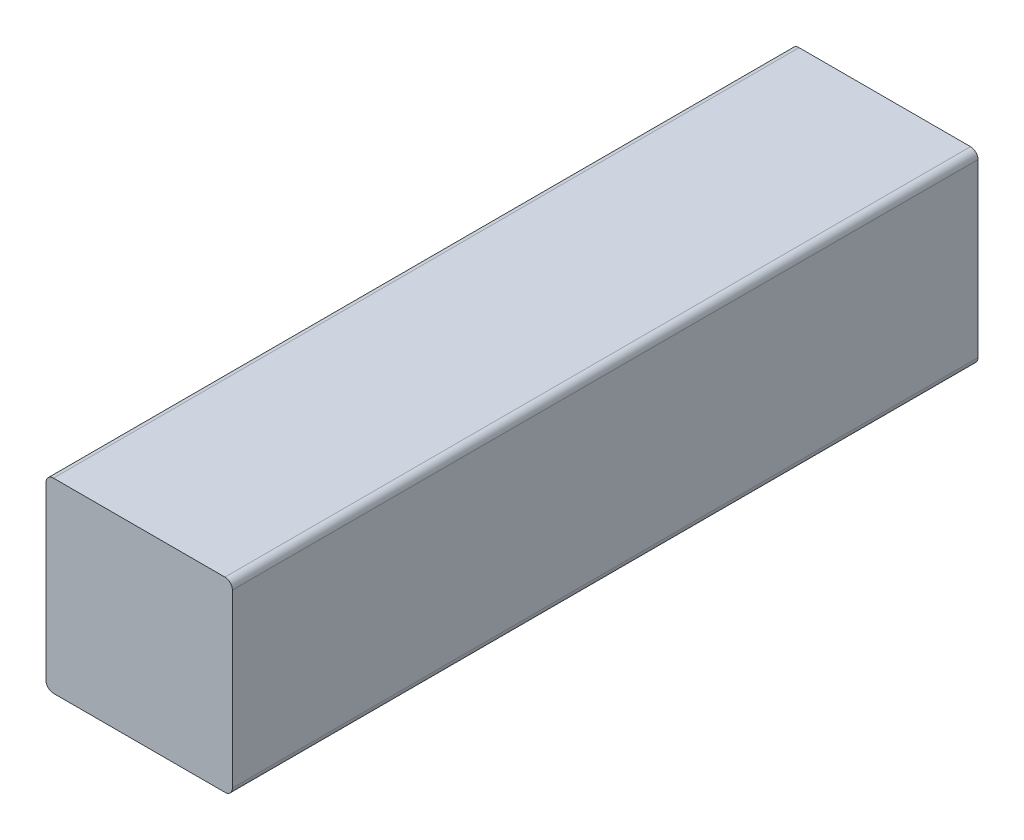
ISO-10303-21;
HEADER;
FILE_DESCRIPTION(('STEP AP214'),'2;1');
FILE_NAME('part.step','',(''),(''),'','','');
FILE_SCHEMA(('AUTOMOTIVE_DESIGN { 1 0 10303 214 1 1 1 1 }'));
ENDSEC;
DATA;
#1=APPLICATION_CONTEXT('core data for automotive mechanical design processes');
#2=APPLICATION_PROTOCOL_DEFINITION('international standard','automotive_design',2000,#1);
#3=PRODUCT_CONTEXT('',#1,'mechanical');
#4=PRODUCT('Part','Part','',(#3));
#5=PRODUCT_RELATED_PRODUCT_CATEGORY('part','',(#4));
#6=PRODUCT_DEFINITION_FORMATION('','',#4);
#7=PRODUCT_DEFINITION_CONTEXT('part definition',#1,'design');
#8=PRODUCT_DEFINITION('design','',#6,#7);
#9=PRODUCT_DEFINITION_SHAPE('','',#8);
#10=(LENGTH_UNIT() NAMED_UNIT(*) SI_UNIT(.MILLI.,.METRE.));
#11=(NAMED_UNIT(*) PLANE_ANGLE_UNIT() SI_UNIT($,.RADIAN.));
#12=(NAMED_UNIT(*) SI_UNIT($,.STERADIAN.) SOLID_ANGLE_UNIT());
#13=UNCERTAINTY_MEASURE_WITH_UNIT(LENGTH_MEASURE(1.E-05),#10,'distance_accuracy_value','');
#14=(GEOMETRIC_REPRESENTATION_CONTEXT(3) GLOBAL_UNCERTAINTY_ASSIGNED_CONTEXT((#13)) GLOBAL_UNIT_ASSIGNED_CONTEXT((#10,
#11,#12)) REPRESENTATION_CONTEXT('',''));
#15=CARTESIAN_POINT('',(0.,0.,0.));
#16=DIRECTION('',(0.,0.,1.));
#17=DIRECTION('',(1.,0.,0.));
#18=AXIS2_PLACEMENT_3D('',#15,#16,#17);
#19=CARTESIAN_POINT('',(3.175,-3.175,12.7));
#20=DIRECTION('',(0.,1.,0.));
#21=DIRECTION('',(0.,0.,1.));
#22=AXIS2_PLACEMENT_3D('',#19,#20,#21);
#23=PLANE('',#22);
#24=DIRECTION('',(-1.,0.,0.));
#25=VECTOR('',#24,1.);
#26=CARTESIAN_POINT('',(3.175,-3.175,12.7));
#27=LINE('',#26,#25);
#28=CARTESIAN_POINT('',(2.921,-3.175,12.7));
#29=VERTEX_POINT('',#28);
#30=CARTESIAN_POINT('',(-2.921,-3.175,12.7));
#31=VERTEX_POINT('',#30);
#32=EDGE_CURVE('E163',#29,#31,#27,.T.);
#33=ORIENTED_EDGE('',*,*,#32,.T.);
#34=DIRECTION('',(0.,0.,-1.));
#35=VECTOR('',#34,1.);
#36=CARTESIAN_POINT('',(-2.921,-3.175,12.7));
#37=LINE('',#36,#35);
#38=CARTESIAN_POINT('',(-2.921,-3.175,-12.7));
#39=VERTEX_POINT('',#38);
#40=EDGE_CURVE('E119',#31,#39,#37,.T.);
#41=ORIENTED_EDGE('',*,*,#40,.T.);
#42=DIRECTION('',(-1.,0.,0.));
#43=VECTOR('',#42,1.);
#44=CARTESIAN_POINT('',(3.175,-3.175,-12.7));
#45=LINE('',#44,#43);
#46=CARTESIAN_POINT('',(2.921,-3.175,-12.7));
#47=VERTEX_POINT('',#46);
#48=EDGE_CURVE('E103',#47,#39,#45,.T.);
#49=ORIENTED_EDGE('',*,*,#48,.F.);
#50=DIRECTION('',(0.,0.,-1.));
#51=VECTOR('',#50,1.);
#52=CARTESIAN_POINT('',(2.921,-3.175,12.7));
#53=LINE('',#52,#51);
#54=EDGE_CURVE('E116',#47,#29,#53,.F.);
#55=ORIENTED_EDGE('',*,*,#54,.T.);
#56=EDGE_LOOP('',(#33,#41,#49,#55));
#57=FACE_BOUND('',#56,.T.);
#58=ADVANCED_FACE('F34',(#57),#23,.F.);
#59=CARTESIAN_POINT('',(3.175,-3.175,-12.7));
#60=DIRECTION('',(0.,0.,1.));
#61=DIRECTION('',(1.,0.,0.));
#62=AXIS2_PLACEMENT_3D('',#59,#60,#61);
#63=PLANE('',#62);
#64=ORIENTED_EDGE('',*,*,#48,.T.);
#65=CARTESIAN_POINT('',(-2.921,-2.921,-12.7));
#66=DIRECTION('',(0.,0.,1.));
#67=DIRECTION('',(1.,0.,0.));
#68=AXIS2_PLACEMENT_3D('',#65,#66,#67);
#69=CIRCLE('',#68,0.254);
#70=CARTESIAN_POINT('',(-3.175,-2.921,-12.7));
#71=VERTEX_POINT('',#70);
#72=EDGE_CURVE('E110',#39,#71,#69,.F.);
#73=ORIENTED_EDGE('',*,*,#72,.T.);
#74=DIRECTION('',(0.,1.,0.));
#75=VECTOR('',#74,1.);
#76=CARTESIAN_POINT('',(-3.175,-3.175,-12.7));
#77=LINE('',#76,#75);
#78=CARTESIAN_POINT('',(-3.175,2.921,-12.7));
#79=VERTEX_POINT('',#78);
#80=EDGE_CURVE('E169',#71,#79,#77,.T.);
#81=ORIENTED_EDGE('',*,*,#80,.T.);
#82=CARTESIAN_POINT('',(-2.921,2.921,-12.7));
#83=DIRECTION('',(0.,0.,1.));
#84=DIRECTION('',(1.,0.,0.));
#85=AXIS2_PLACEMENT_3D('',#82,#83,#84);
#86=CIRCLE('',#85,0.254);
#87=CARTESIAN_POINT('',(-2.921,3.175,-12.7));
#88=VERTEX_POINT('',#87);
#89=EDGE_CURVE('E111',#79,#88,#86,.F.);
#90=ORIENTED_EDGE('',*,*,#89,.T.);
#91=DIRECTION('',(-1.,0.,0.));
#92=VECTOR('',#91,1.);
#93=CARTESIAN_POINT('',(3.175,3.175,-12.7));
#94=LINE('',#93,#92);
#95=CARTESIAN_POINT('',(2.921,3.175,-12.7));
#96=VERTEX_POINT('',#95);
#97=EDGE_CURVE('E120',#96,#88,#94,.T.);
#98=ORIENTED_EDGE('',*,*,#97,.F.);
#99=CARTESIAN_POINT('',(2.921,2.921,-12.7));
#100=DIRECTION('',(0.,0.,1.));
#101=DIRECTION('',(1.,0.,0.));
#102=AXIS2_PLACEMENT_3D('',#99,#100,#101);
#103=CIRCLE('',#102,0.254);
#104=CARTESIAN_POINT('',(3.175,2.921,-12.7));
#105=VERTEX_POINT('',#104);
#106=EDGE_CURVE('E126',#96,#105,#103,.F.);
#107=ORIENTED_EDGE('',*,*,#106,.T.);
#108=DIRECTION('',(0.,1.,0.));
#109=VECTOR('',#108,1.);
#110=CARTESIAN_POINT('',(3.175,-3.175,-12.7));
#111=LINE('',#110,#109);
#112=CARTESIAN_POINT('',(3.175,-2.921,-12.7));
#113=VERTEX_POINT('',#112);
#114=EDGE_CURVE('E105',#113,#105,#111,.T.);
#115=ORIENTED_EDGE('',*,*,#114,.F.);
#116=CARTESIAN_POINT('',(2.921,-2.921,-12.7));
#117=DIRECTION('',(0.,0.,1.));
#118=DIRECTION('',(1.,0.,0.));
#119=AXIS2_PLACEMENT_3D('',#116,#117,#118);
#120=CIRCLE('',#119,0.254);
#121=EDGE_CURVE('E100',#113,#47,#120,.F.);
#122=ORIENTED_EDGE('',*,*,#121,.T.);
#123=EDGE_LOOP('',(#64,#73,#81,#90,#98,#107,#115,#122));
#124=FACE_BOUND('',#123,.T.);
#125=ADVANCED_FACE('F102',(#124),#63,.F.);
#126=CARTESIAN_POINT('',(3.175,3.175,12.7));
#127=DIRECTION('',(0.,-1.,0.));
#128=DIRECTION('',(0.,0.,-1.));
#129=AXIS2_PLACEMENT_3D('',#126,#127,#128);
#130=PLANE('',#129);
#131=ORIENTED_EDGE('',*,*,#97,.T.);
#132=DIRECTION('',(0.,0.,1.));
#133=VECTOR('',#132,1.);
#134=CARTESIAN_POINT('',(-2.921,3.175,12.7));
#135=LINE('',#134,#133);
#136=CARTESIAN_POINT('',(-2.921,3.175,12.7));
#137=VERTEX_POINT('',#136);
#138=EDGE_CURVE('E11',#88,#137,#135,.T.);
#139=ORIENTED_EDGE('',*,*,#138,.T.);
#140=DIRECTION('',(-1.,0.,0.));
#141=VECTOR('',#140,1.);
#142=CARTESIAN_POINT('',(3.175,3.175,12.7));
#143=LINE('',#142,#141);
#144=CARTESIAN_POINT('',(2.921,3.175,12.7));
#145=VERTEX_POINT('',#144);
#146=EDGE_CURVE('E151',#145,#137,#143,.T.);
#147=ORIENTED_EDGE('',*,*,#146,.F.);
#148=DIRECTION('',(0.,0.,1.));
#149=VECTOR('',#148,1.);
#150=CARTESIAN_POINT('',(2.921,3.175,-12.7));
#151=LINE('',#150,#149);
#152=EDGE_CURVE('E42',#145,#96,#151,.F.);
#153=ORIENTED_EDGE('',*,*,#152,.T.);
#154=EDGE_LOOP('',(#131,#139,#147,#153));
#155=FACE_BOUND('',#154,.T.);
#156=ADVANCED_FACE('F150',(#155),#130,.F.);
#157=CARTESIAN_POINT('',(3.175,-3.175,12.7));
#158=DIRECTION('',(0.,0.,-1.));
#159=DIRECTION('',(-1.,0.,0.));
#160=AXIS2_PLACEMENT_3D('',#157,#158,#159);
#161=PLANE('',#160);
#162=DIRECTION('',(0.,-1.,0.));
#163=VECTOR('',#162,1.);
#164=CARTESIAN_POINT('',(-3.175,-3.175,12.7));
#165=LINE('',#164,#163);
#166=CARTESIAN_POINT('',(-3.175,2.921,12.7));
#167=VERTEX_POINT('',#166);
#168=CARTESIAN_POINT('',(-3.175,-2.921,12.7));
#169=VERTEX_POINT('',#168);
#170=EDGE_CURVE('E166',#167,#169,#165,.T.);
#171=ORIENTED_EDGE('',*,*,#170,.T.);
#172=CARTESIAN_POINT('',(-2.921,-2.921,12.7));
#173=DIRECTION('',(0.,0.,-1.));
#174=DIRECTION('',(-1.,0.,0.));
#175=AXIS2_PLACEMENT_3D('',#172,#173,#174);
#176=CIRCLE('',#175,0.254);
#177=EDGE_CURVE('E140',#169,#31,#176,.F.);
#178=ORIENTED_EDGE('',*,*,#177,.T.);
#179=ORIENTED_EDGE('',*,*,#32,.F.);
#180=CARTESIAN_POINT('',(2.921,-2.921,12.7));
#181=DIRECTION('',(0.,0.,-1.));
#182=DIRECTION('',(-1.,0.,0.));
#183=AXIS2_PLACEMENT_3D('',#180,#181,#182);
#184=CIRCLE('',#183,0.254);
#185=CARTESIAN_POINT('',(3.175,-2.921,12.7));
#186=VERTEX_POINT('',#185);
#187=EDGE_CURVE('E124',#29,#186,#184,.F.);
#188=ORIENTED_EDGE('',*,*,#187,.T.);
#189=DIRECTION('',(0.,-1.,0.));
#190=VECTOR('',#189,1.);
#191=CARTESIAN_POINT('',(3.175,-3.175,12.7));
#192=LINE('',#191,#190);
#193=CARTESIAN_POINT('',(3.175,2.921,12.7));
#194=VERTEX_POINT('',#193);
#195=EDGE_CURVE('E160',#194,#186,#192,.T.);
#196=ORIENTED_EDGE('',*,*,#195,.F.);
#197=CARTESIAN_POINT('',(2.921,2.921,12.7));
#198=DIRECTION('',(0.,0.,-1.));
#199=DIRECTION('',(-1.,0.,0.));
#200=AXIS2_PLACEMENT_3D('',#197,#198,#199);
#201=CIRCLE('',#200,0.254);
#202=EDGE_CURVE('E56',#194,#145,#201,.F.);
#203=ORIENTED_EDGE('',*,*,#202,.T.);
#204=ORIENTED_EDGE('',*,*,#146,.T.);
#205=CARTESIAN_POINT('',(-2.921,2.921,12.7));
#206=DIRECTION('',(0.,0.,-1.));
#207=DIRECTION('',(-1.,0.,0.));
#208=AXIS2_PLACEMENT_3D('',#205,#206,#207);
#209=CIRCLE('',#208,0.254);
#210=EDGE_CURVE('E49',#137,#167,#209,.F.);
#211=ORIENTED_EDGE('',*,*,#210,.T.);
#212=EDGE_LOOP('',(#171,#178,#179,#188,#196,#203,#204,#211));
#213=FACE_BOUND('',#212,.T.);
#214=ADVANCED_FACE('F162',(#213),#161,.F.);
#215=CARTESIAN_POINT('',(3.175,0.,0.));
#216=DIRECTION('',(1.,0.,0.));
#217=DIRECTION('',(0.,0.,-1.));
#218=AXIS2_PLACEMENT_3D('',#215,#216,#217);
#219=PLANE('',#218);
#220=ORIENTED_EDGE('',*,*,#195,.T.);
#221=DIRECTION('',(0.,0.,-1.));
#222=VECTOR('',#221,1.);
#223=CARTESIAN_POINT('',(3.175,-2.921,-12.7));
#224=LINE('',#223,#222);
#225=EDGE_CURVE('E145',#186,#113,#224,.T.);
#226=ORIENTED_EDGE('',*,*,#225,.T.);
#227=ORIENTED_EDGE('',*,*,#114,.T.);
#228=DIRECTION('',(0.,0.,1.));
#229=VECTOR('',#228,1.);
#230=CARTESIAN_POINT('',(3.175,2.921,12.7));
#231=LINE('',#230,#229);
#232=EDGE_CURVE('E142',#105,#194,#231,.T.);
#233=ORIENTED_EDGE('',*,*,#232,.T.);
#234=EDGE_LOOP('',(#220,#226,#227,#233));
#235=FACE_BOUND('',#234,.T.);
#236=ADVANCED_FACE('F159',(#235),#219,.T.);
#237=CARTESIAN_POINT('',(-3.175,0.,0.));
#238=DIRECTION('',(1.,0.,0.));
#239=DIRECTION('',(0.,0.,-1.));
#240=AXIS2_PLACEMENT_3D('',#237,#238,#239);
#241=PLANE('',#240);
#242=ORIENTED_EDGE('',*,*,#80,.F.);
#243=DIRECTION('',(0.,0.,-1.));
#244=VECTOR('',#243,1.);
#245=CARTESIAN_POINT('',(-3.175,-2.921,0.));
#246=LINE('',#245,#244);
#247=EDGE_CURVE('E135',#71,#169,#246,.F.);
#248=ORIENTED_EDGE('',*,*,#247,.T.);
#249=ORIENTED_EDGE('',*,*,#170,.F.);
#250=DIRECTION('',(0.,0.,1.));
#251=VECTOR('',#250,1.);
#252=CARTESIAN_POINT('',(-3.175,2.921,0.));
#253=LINE('',#252,#251);
#254=EDGE_CURVE('E133',#167,#79,#253,.F.);
#255=ORIENTED_EDGE('',*,*,#254,.T.);
#256=EDGE_LOOP('',(#242,#248,#249,#255));
#257=FACE_BOUND('',#256,.T.);
#258=ADVANCED_FACE('F176',(#257),#241,.F.);
#259=CARTESIAN_POINT('',(-2.921,-2.921,12.7));
#260=DIRECTION('',(0.,0.,-1.));
#261=DIRECTION('',(0.,1.,0.));
#262=AXIS2_PLACEMENT_3D('',#259,#260,#261);
#263=CYLINDRICAL_SURFACE('',#262,0.254);
#264=ORIENTED_EDGE('',*,*,#177,.F.);
#265=ORIENTED_EDGE('',*,*,#247,.F.);
#266=ORIENTED_EDGE('',*,*,#72,.F.);
#267=ORIENTED_EDGE('',*,*,#40,.F.);
#268=EDGE_LOOP('',(#264,#265,#266,#267));
#269=FACE_BOUND('',#268,.T.);
#270=ADVANCED_FACE('F184',(#269),#263,.T.);
#271=CARTESIAN_POINT('',(2.921,-2.921,0.));
#272=DIRECTION('',(0.,0.,1.));
#273=DIRECTION('',(0.,-1.,0.));
#274=AXIS2_PLACEMENT_3D('',#271,#272,#273);
#275=CYLINDRICAL_SURFACE('',#274,0.254);
#276=ORIENTED_EDGE('',*,*,#187,.F.);
#277=ORIENTED_EDGE('',*,*,#54,.F.);
#278=ORIENTED_EDGE('',*,*,#121,.F.);
#279=ORIENTED_EDGE('',*,*,#225,.F.);
#280=EDGE_LOOP('',(#276,#277,#278,#279));
#281=FACE_BOUND('',#280,.T.);
#282=ADVANCED_FACE('F123',(#281),#275,.T.);
#283=CARTESIAN_POINT('',(-2.921,2.921,12.7));
#284=DIRECTION('',(0.,0.,1.));
#285=DIRECTION('',(0.,-1.,0.));
#286=AXIS2_PLACEMENT_3D('',#283,#284,#285);
#287=CYLINDRICAL_SURFACE('',#286,0.254);
#288=ORIENTED_EDGE('',*,*,#89,.F.);
#289=ORIENTED_EDGE('',*,*,#254,.F.);
#290=ORIENTED_EDGE('',*,*,#210,.F.);
#291=ORIENTED_EDGE('',*,*,#138,.F.);
#292=EDGE_LOOP('',(#288,#289,#290,#291));
#293=FACE_BOUND('',#292,.T.);
#294=ADVANCED_FACE('F178',(#293),#287,.T.);
#295=CARTESIAN_POINT('',(2.921,2.921,0.));
#296=DIRECTION('',(0.,0.,-1.));
#297=DIRECTION('',(0.,1.,0.));
#298=AXIS2_PLACEMENT_3D('',#295,#296,#297);
#299=CYLINDRICAL_SURFACE('',#298,0.254);
#300=ORIENTED_EDGE('',*,*,#106,.F.);
#301=ORIENTED_EDGE('',*,*,#152,.F.);
#302=ORIENTED_EDGE('',*,*,#202,.F.);
#303=ORIENTED_EDGE('',*,*,#232,.F.);
#304=EDGE_LOOP('',(#300,#301,#302,#303));
#305=FACE_BOUND('',#304,.T.);
#306=ADVANCED_FACE('F36',(#305),#299,.T.);
#307=CLOSED_SHELL('',(#58,#125,#156,#214,#236,#258,#270,#282,#294,#306));
#308=MANIFOLD_SOLID_BREP('B2',#307);
#309=ADVANCED_BREP_SHAPE_REPRESENTATION('',(#18,#308),#14);
#310=SHAPE_DEFINITION_REPRESENTATION(#9,#309);
ENDSEC;
END-ISO-10303-21;
